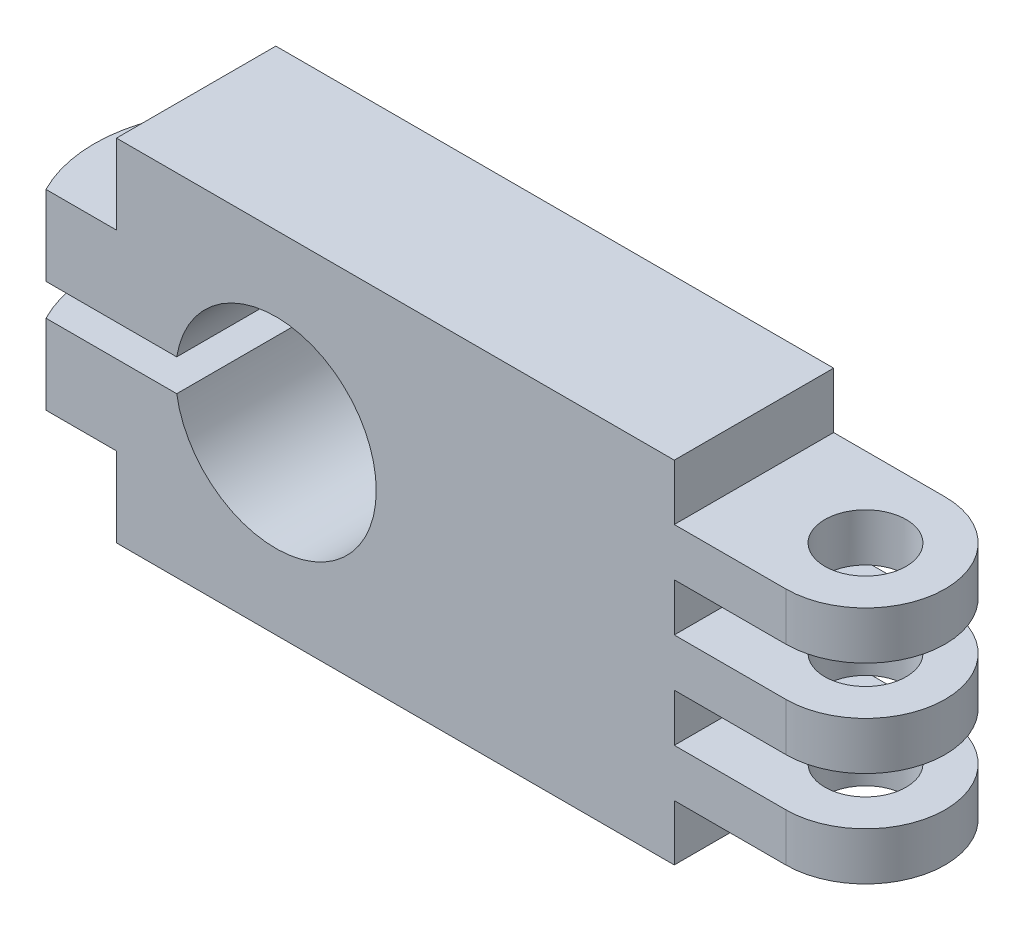
ISO-10303-21;
HEADER;
FILE_DESCRIPTION(('STEP AP214'),'2;1');
FILE_NAME('part.step','',(''),(''),'','','');
FILE_SCHEMA(('AUTOMOTIVE_DESIGN { 1 0 10303 214 1 1 1 1 }'));
ENDSEC;
DATA;
#1=APPLICATION_CONTEXT('core data for automotive mechanical design processes');
#2=APPLICATION_PROTOCOL_DEFINITION('international standard','automotive_design',2000,#1);
#3=PRODUCT_CONTEXT('',#1,'mechanical');
#4=PRODUCT('Part','Part','',(#3));
#5=PRODUCT_RELATED_PRODUCT_CATEGORY('part','',(#4));
#6=PRODUCT_DEFINITION_FORMATION('','',#4);
#7=PRODUCT_DEFINITION_CONTEXT('part definition',#1,'design');
#8=PRODUCT_DEFINITION('design','',#6,#7);
#9=PRODUCT_DEFINITION_SHAPE('','',#8);
#10=(LENGTH_UNIT() NAMED_UNIT(*) SI_UNIT(.MILLI.,.METRE.));
#11=(NAMED_UNIT(*) PLANE_ANGLE_UNIT() SI_UNIT($,.RADIAN.));
#12=(NAMED_UNIT(*) SI_UNIT($,.STERADIAN.) SOLID_ANGLE_UNIT());
#13=UNCERTAINTY_MEASURE_WITH_UNIT(LENGTH_MEASURE(1.E-05),#10,'distance_accuracy_value','');
#14=(GEOMETRIC_REPRESENTATION_CONTEXT(3) GLOBAL_UNCERTAINTY_ASSIGNED_CONTEXT((#13)) GLOBAL_UNIT_ASSIGNED_CONTEXT((#10,
#11,#12)) REPRESENTATION_CONTEXT('',''));
#15=CARTESIAN_POINT('',(0.,0.,0.));
#16=DIRECTION('',(0.,0.,1.));
#17=DIRECTION('',(1.,0.,0.));
#18=AXIS2_PLACEMENT_3D('',#15,#16,#17);
#19=CARTESIAN_POINT('',(-10.,-5.,10.));
#20=DIRECTION('',(0.,1.,0.));
#21=DIRECTION('',(0.,0.,1.));
#22=AXIS2_PLACEMENT_3D('',#19,#20,#21);
#23=PLANE('',#22);
#24=CARTESIAN_POINT('',(-2.5,-5.,6.));
#25=DIRECTION('',(0.,1.,0.));
#26=DIRECTION('',(0.,0.,1.));
#27=AXIS2_PLACEMENT_3D('',#24,#25,#26);
#28=CIRCLE('',#27,1.);
#29=CARTESIAN_POINT('',(-2.5,-5.,7.));
#30=VERTEX_POINT('',#29);
#31=EDGE_CURVE('E431',#30,#30,#28,.T.);
#32=ORIENTED_EDGE('',*,*,#31,.F.);
#33=EDGE_LOOP('',(#32));
#34=FACE_BOUND('',#33,.T.);
#35=CARTESIAN_POINT('',(3.31673634690876,-5.,6.));
#36=DIRECTION('',(0.,-1.,0.));
#37=DIRECTION('',(0.,0.,1.));
#38=AXIS2_PLACEMENT_3D('',#35,#36,#37);
#39=CIRCLE('',#38,8.71212706957137);
#40=CARTESIAN_POINT('',(-4.42284749696542,-5.,10.));
#41=VERTEX_POINT('',#40);
#42=CARTESIAN_POINT('',(-3.,-5.,0.));
#43=VERTEX_POINT('',#42);
#44=EDGE_CURVE('E49',#41,#43,#39,.T.);
#45=ORIENTED_EDGE('',*,*,#44,.F.);
#46=DIRECTION('',(1.,0.,0.));
#47=VECTOR('',#46,1.);
#48=CARTESIAN_POINT('',(-10.,-5.,10.));
#49=LINE('',#48,#47);
#50=CARTESIAN_POINT('',(0.,-5.,10.));
#51=VERTEX_POINT('',#50);
#52=EDGE_CURVE('E204',#41,#51,#49,.T.);
#53=ORIENTED_EDGE('',*,*,#52,.T.);
#54=DIRECTION('',(0.,0.,-1.));
#55=VECTOR('',#54,1.);
#56=CARTESIAN_POINT('',(0.,-5.,10.));
#57=LINE('',#56,#55);
#58=CARTESIAN_POINT('',(0.,-5.,0.));
#59=VERTEX_POINT('',#58);
#60=EDGE_CURVE('E268',#51,#59,#57,.T.);
#61=ORIENTED_EDGE('',*,*,#60,.T.);
#62=DIRECTION('',(1.,0.,0.));
#63=VECTOR('',#62,1.);
#64=CARTESIAN_POINT('',(-10.,-5.,0.));
#65=LINE('',#64,#63);
#66=EDGE_CURVE('E206',#43,#59,#65,.T.);
#67=ORIENTED_EDGE('',*,*,#66,.F.);
#68=EDGE_LOOP('',(#45,#53,#61,#67));
#69=FACE_BOUND('',#68,.T.);
#70=ADVANCED_FACE('F34',(#34,#69),#23,.T.);
#71=CARTESIAN_POINT('',(-10.,-10.,10.));
#72=DIRECTION('',(0.,1.,0.));
#73=DIRECTION('',(0.,0.,1.));
#74=AXIS2_PLACEMENT_3D('',#71,#72,#73);
#75=PLANE('',#74);
#76=CARTESIAN_POINT('',(-2.5,-10.,6.));
#77=DIRECTION('',(0.,1.,0.));
#78=DIRECTION('',(0.,0.,1.));
#79=AXIS2_PLACEMENT_3D('',#76,#77,#78);
#80=CIRCLE('',#79,1.);
#81=CARTESIAN_POINT('',(-2.5,-10.,7.));
#82=VERTEX_POINT('',#81);
#83=EDGE_CURVE('E207',#82,#82,#80,.T.);
#84=ORIENTED_EDGE('',*,*,#83,.T.);
#85=EDGE_LOOP('',(#84));
#86=FACE_BOUND('',#85,.T.);
#87=DIRECTION('',(1.,0.,0.));
#88=VECTOR('',#87,1.);
#89=CARTESIAN_POINT('',(-10.,-10.,10.));
#90=LINE('',#89,#88);
#91=CARTESIAN_POINT('',(-4.42284749696542,-10.,10.));
#92=VERTEX_POINT('',#91);
#93=CARTESIAN_POINT('',(3.7798713839664,-10.,10.));
#94=VERTEX_POINT('',#93);
#95=EDGE_CURVE('E266',#92,#94,#90,.T.);
#96=ORIENTED_EDGE('',*,*,#95,.F.);
#97=CARTESIAN_POINT('',(3.31673634690876,-10.,6.));
#98=DIRECTION('',(0.,1.,0.));
#99=DIRECTION('',(0.,0.,1.));
#100=AXIS2_PLACEMENT_3D('',#97,#98,#99);
#101=CIRCLE('',#100,8.71212706957137);
#102=CARTESIAN_POINT('',(-3.,-10.,0.));
#103=VERTEX_POINT('',#102);
#104=EDGE_CURVE('E195',#92,#103,#101,.F.);
#105=ORIENTED_EDGE('',*,*,#104,.T.);
#106=DIRECTION('',(1.,0.,0.));
#107=VECTOR('',#106,1.);
#108=CARTESIAN_POINT('',(-10.,-10.,0.));
#109=LINE('',#108,#107);
#110=CARTESIAN_POINT('',(3.7798713839664,-10.,0.));
#111=VERTEX_POINT('',#110);
#112=EDGE_CURVE('E215',#103,#111,#109,.T.);
#113=ORIENTED_EDGE('',*,*,#112,.T.);
#114=DIRECTION('',(0.,0.,1.));
#115=VECTOR('',#114,1.);
#116=CARTESIAN_POINT('',(3.7798713839664,-10.,-9.));
#117=LINE('',#116,#115);
#118=EDGE_CURVE('E365',#111,#94,#117,.T.);
#119=ORIENTED_EDGE('',*,*,#118,.T.);
#120=EDGE_LOOP('',(#96,#105,#113,#119));
#121=FACE_BOUND('',#120,.T.);
#122=ADVANCED_FACE('F351',(#86,#121),#75,.F.);
#123=CARTESIAN_POINT('',(0.,-12.,10.));
#124=DIRECTION('',(0.,-1.,0.));
#125=DIRECTION('',(0.,0.,-1.));
#126=AXIS2_PLACEMENT_3D('',#123,#124,#125);
#127=PLANE('',#126);
#128=CARTESIAN_POINT('',(-2.5,-12.,6.));
#129=DIRECTION('',(0.,-1.,0.));
#130=DIRECTION('',(0.,0.,-1.));
#131=AXIS2_PLACEMENT_3D('',#128,#129,#130);
#132=CIRCLE('',#131,1.);
#133=CARTESIAN_POINT('',(-2.5,-12.,5.));
#134=VERTEX_POINT('',#133);
#135=EDGE_CURVE('E435',#134,#134,#132,.T.);
#136=ORIENTED_EDGE('',*,*,#135,.T.);
#137=EDGE_LOOP('',(#136));
#138=FACE_BOUND('',#137,.T.);
#139=DIRECTION('',(-1.,0.,0.));
#140=VECTOR('',#139,1.);
#141=CARTESIAN_POINT('',(0.,-12.,0.));
#142=LINE('',#141,#140);
#143=CARTESIAN_POINT('',(3.7798713839664,-12.,0.));
#144=VERTEX_POINT('',#143);
#145=CARTESIAN_POINT('',(-3.,-12.,0.));
#146=VERTEX_POINT('',#145);
#147=EDGE_CURVE('E219',#144,#146,#142,.T.);
#148=ORIENTED_EDGE('',*,*,#147,.T.);
#149=CARTESIAN_POINT('',(3.31673634690876,-12.,6.));
#150=DIRECTION('',(0.,-1.,0.));
#151=DIRECTION('',(0.,0.,-1.));
#152=AXIS2_PLACEMENT_3D('',#149,#150,#151);
#153=CIRCLE('',#152,8.71212706957137);
#154=CARTESIAN_POINT('',(-4.42284749696542,-12.,10.));
#155=VERTEX_POINT('',#154);
#156=EDGE_CURVE('E57',#146,#155,#153,.F.);
#157=ORIENTED_EDGE('',*,*,#156,.T.);
#158=DIRECTION('',(-1.,0.,0.));
#159=VECTOR('',#158,1.);
#160=CARTESIAN_POINT('',(0.,-12.,10.));
#161=LINE('',#160,#159);
#162=CARTESIAN_POINT('',(3.77987138396641,-12.,10.));
#163=VERTEX_POINT('',#162);
#164=EDGE_CURVE('E263',#163,#155,#161,.T.);
#165=ORIENTED_EDGE('',*,*,#164,.F.);
#166=DIRECTION('',(0.,0.,1.));
#167=VECTOR('',#166,1.);
#168=CARTESIAN_POINT('',(3.7798713839664,-12.,-9.));
#169=LINE('',#168,#167);
#170=EDGE_CURVE('E357',#163,#144,#169,.F.);
#171=ORIENTED_EDGE('',*,*,#170,.T.);
#172=EDGE_LOOP('',(#148,#157,#165,#171));
#173=FACE_BOUND('',#172,.T.);
#174=ADVANCED_FACE('F426',(#138,#173),#127,.F.);
#175=CARTESIAN_POINT('',(0.,-17.,10.));
#176=DIRECTION('',(0.,-1.,0.));
#177=DIRECTION('',(0.,0.,-1.));
#178=AXIS2_PLACEMENT_3D('',#175,#176,#177);
#179=PLANE('',#178);
#180=CARTESIAN_POINT('',(-2.5,-17.,6.));
#181=DIRECTION('',(0.,-1.,0.));
#182=DIRECTION('',(0.,0.,-1.));
#183=AXIS2_PLACEMENT_3D('',#180,#181,#182);
#184=CIRCLE('',#183,1.);
#185=CARTESIAN_POINT('',(-2.5,-17.,5.));
#186=VERTEX_POINT('',#185);
#187=EDGE_CURVE('E37',#186,#186,#184,.T.);
#188=ORIENTED_EDGE('',*,*,#187,.F.);
#189=EDGE_LOOP('',(#188));
#190=FACE_BOUND('',#189,.T.);
#191=CARTESIAN_POINT('',(3.31673634690876,-17.,6.));
#192=DIRECTION('',(0.,-1.,0.));
#193=DIRECTION('',(0.,0.,-1.));
#194=AXIS2_PLACEMENT_3D('',#191,#192,#193);
#195=CIRCLE('',#194,8.71212706957137);
#196=CARTESIAN_POINT('',(-3.,-17.,0.));
#197=VERTEX_POINT('',#196);
#198=CARTESIAN_POINT('',(-4.42284749696542,-17.,10.));
#199=VERTEX_POINT('',#198);
#200=EDGE_CURVE('E359',#197,#199,#195,.F.);
#201=ORIENTED_EDGE('',*,*,#200,.F.);
#202=DIRECTION('',(-1.,0.,0.));
#203=VECTOR('',#202,1.);
#204=CARTESIAN_POINT('',(0.,-17.,0.));
#205=LINE('',#204,#203);
#206=CARTESIAN_POINT('',(0.,-17.,0.));
#207=VERTEX_POINT('',#206);
#208=EDGE_CURVE('E309',#207,#197,#205,.T.);
#209=ORIENTED_EDGE('',*,*,#208,.F.);
#210=DIRECTION('',(0.,0.,-1.));
#211=VECTOR('',#210,1.);
#212=CARTESIAN_POINT('',(0.,-17.,10.));
#213=LINE('',#212,#211);
#214=CARTESIAN_POINT('',(0.,-17.,10.));
#215=VERTEX_POINT('',#214);
#216=EDGE_CURVE('E314',#215,#207,#213,.T.);
#217=ORIENTED_EDGE('',*,*,#216,.F.);
#218=DIRECTION('',(-1.,0.,0.));
#219=VECTOR('',#218,1.);
#220=CARTESIAN_POINT('',(0.,-17.,10.));
#221=LINE('',#220,#219);
#222=EDGE_CURVE('E260',#215,#199,#221,.T.);
#223=ORIENTED_EDGE('',*,*,#222,.T.);
#224=EDGE_LOOP('',(#201,#209,#217,#223));
#225=FACE_BOUND('',#224,.T.);
#226=ADVANCED_FACE('F451',(#190,#225),#179,.T.);
#227=CARTESIAN_POINT('',(0.,-22.,10.));
#228=DIRECTION('',(-1.,0.,0.));
#229=DIRECTION('',(0.,0.,1.));
#230=AXIS2_PLACEMENT_3D('',#227,#228,#229);
#231=PLANE('',#230);
#232=DIRECTION('',(0.,1.,0.));
#233=VECTOR('',#232,1.);
#234=CARTESIAN_POINT('',(0.,-22.,0.));
#235=LINE('',#234,#233);
#236=CARTESIAN_POINT('',(0.,-22.,0.));
#237=VERTEX_POINT('',#236);
#238=EDGE_CURVE('E306',#237,#207,#235,.T.);
#239=ORIENTED_EDGE('',*,*,#238,.F.);
#240=DIRECTION('',(0.,0.,-1.));
#241=VECTOR('',#240,1.);
#242=CARTESIAN_POINT('',(0.,-22.,10.));
#243=LINE('',#242,#241);
#244=CARTESIAN_POINT('',(0.,-22.,10.));
#245=VERTEX_POINT('',#244);
#246=EDGE_CURVE('E317',#245,#237,#243,.T.);
#247=ORIENTED_EDGE('',*,*,#246,.F.);
#248=DIRECTION('',(0.,1.,0.));
#249=VECTOR('',#248,1.);
#250=CARTESIAN_POINT('',(0.,-22.,10.));
#251=LINE('',#250,#249);
#252=EDGE_CURVE('E257',#245,#215,#251,.T.);
#253=ORIENTED_EDGE('',*,*,#252,.T.);
#254=ORIENTED_EDGE('',*,*,#216,.T.);
#255=EDGE_LOOP('',(#239,#247,#253,#254));
#256=FACE_BOUND('',#255,.T.);
#257=ADVANCED_FACE('F456',(#256),#231,.T.);
#258=CARTESIAN_POINT('',(35.,-22.,10.));
#259=DIRECTION('',(0.,-1.,0.));
#260=DIRECTION('',(0.,0.,-1.));
#261=AXIS2_PLACEMENT_3D('',#258,#259,#260);
#262=PLANE('',#261);
#263=DIRECTION('',(-1.,0.,0.));
#264=VECTOR('',#263,1.);
#265=CARTESIAN_POINT('',(35.,-22.,0.));
#266=LINE('',#265,#264);
#267=CARTESIAN_POINT('',(35.,-22.,0.));
#268=VERTEX_POINT('',#267);
#269=EDGE_CURVE('E303',#268,#237,#266,.T.);
#270=ORIENTED_EDGE('',*,*,#269,.F.);
#271=DIRECTION('',(0.,0.,-1.));
#272=VECTOR('',#271,1.);
#273=CARTESIAN_POINT('',(35.,-22.,10.));
#274=LINE('',#273,#272);
#275=CARTESIAN_POINT('',(35.,-22.,10.));
#276=VERTEX_POINT('',#275);
#277=EDGE_CURVE('E319',#276,#268,#274,.T.);
#278=ORIENTED_EDGE('',*,*,#277,.F.);
#279=DIRECTION('',(-1.,0.,0.));
#280=VECTOR('',#279,1.);
#281=CARTESIAN_POINT('',(35.,-22.,10.));
#282=LINE('',#281,#280);
#283=EDGE_CURVE('E254',#276,#245,#282,.T.);
#284=ORIENTED_EDGE('',*,*,#283,.T.);
#285=ORIENTED_EDGE('',*,*,#246,.T.);
#286=EDGE_LOOP('',(#270,#278,#284,#285));
#287=FACE_BOUND('',#286,.T.);
#288=ADVANCED_FACE('F417',(#287),#262,.T.);
#289=CARTESIAN_POINT('',(35.,-18.5,10.));
#290=DIRECTION('',(1.,0.,0.));
#291=DIRECTION('',(0.,0.,-1.));
#292=AXIS2_PLACEMENT_3D('',#289,#290,#291);
#293=PLANE('',#292);
#294=DIRECTION('',(0.,-1.,0.));
#295=VECTOR('',#294,1.);
#296=CARTESIAN_POINT('',(35.,-18.5,0.));
#297=LINE('',#296,#295);
#298=CARTESIAN_POINT('',(35.,-18.5,0.));
#299=VERTEX_POINT('',#298);
#300=EDGE_CURVE('E300',#299,#268,#297,.T.);
#301=ORIENTED_EDGE('',*,*,#300,.F.);
#302=DIRECTION('',(0.,0.,-1.));
#303=VECTOR('',#302,1.);
#304=CARTESIAN_POINT('',(35.,-18.5,10.));
#305=LINE('',#304,#303);
#306=CARTESIAN_POINT('',(35.,-18.5,10.));
#307=VERTEX_POINT('',#306);
#308=EDGE_CURVE('E321',#307,#299,#305,.T.);
#309=ORIENTED_EDGE('',*,*,#308,.F.);
#310=DIRECTION('',(0.,-1.,0.));
#311=VECTOR('',#310,1.);
#312=CARTESIAN_POINT('',(35.,-18.5,10.));
#313=LINE('',#312,#311);
#314=EDGE_CURVE('E251',#307,#276,#313,.T.);
#315=ORIENTED_EDGE('',*,*,#314,.T.);
#316=ORIENTED_EDGE('',*,*,#277,.T.);
#317=EDGE_LOOP('',(#301,#309,#315,#316));
#318=FACE_BOUND('',#317,.T.);
#319=ADVANCED_FACE('F407',(#318),#293,.T.);
#320=CARTESIAN_POINT('',(47.,-18.5,10.));
#321=DIRECTION('',(0.,-1.,0.));
#322=DIRECTION('',(0.,0.,-1.));
#323=AXIS2_PLACEMENT_3D('',#320,#321,#322);
#324=PLANE('',#323);
#325=CARTESIAN_POINT('',(42.,-18.5,5.));
#326=DIRECTION('',(0.,-1.,0.));
#327=DIRECTION('',(0.,0.,-1.));
#328=AXIS2_PLACEMENT_3D('',#325,#326,#327);
#329=CIRCLE('',#328,5.);
#330=CARTESIAN_POINT('',(42.,-18.5,10.));
#331=VERTEX_POINT('',#330);
#332=CARTESIAN_POINT('',(42.,-18.5,0.));
#333=VERTEX_POINT('',#332);
#334=EDGE_CURVE('E382',#331,#333,#329,.F.);
#335=ORIENTED_EDGE('',*,*,#334,.F.);
#336=DIRECTION('',(-1.,0.,0.));
#337=VECTOR('',#336,1.);
#338=CARTESIAN_POINT('',(47.,-18.5,10.));
#339=LINE('',#338,#337);
#340=EDGE_CURVE('E249',#331,#307,#339,.T.);
#341=ORIENTED_EDGE('',*,*,#340,.T.);
#342=ORIENTED_EDGE('',*,*,#308,.T.);
#343=DIRECTION('',(-1.,0.,0.));
#344=VECTOR('',#343,1.);
#345=CARTESIAN_POINT('',(47.,-18.5,0.));
#346=LINE('',#345,#344);
#347=EDGE_CURVE('E298',#333,#299,#346,.T.);
#348=ORIENTED_EDGE('',*,*,#347,.F.);
#349=EDGE_LOOP('',(#335,#341,#342,#348));
#350=FACE_BOUND('',#349,.T.);
#351=CARTESIAN_POINT('',(42.,-18.5,5.));
#352=DIRECTION('',(0.,-1.,0.));
#353=DIRECTION('',(0.,0.,-1.));
#354=AXIS2_PLACEMENT_3D('',#351,#352,#353);
#355=CIRCLE('',#354,2.55);
#356=CARTESIAN_POINT('',(42.,-18.5,2.45));
#357=VERTEX_POINT('',#356);
#358=EDGE_CURVE('E222',#357,#357,#355,.T.);
#359=ORIENTED_EDGE('',*,*,#358,.F.);
#360=EDGE_LOOP('',(#359));
#361=FACE_BOUND('',#360,.T.);
#362=ADVANCED_FACE('F404',(#350,#361),#324,.T.);
#363=CARTESIAN_POINT('',(35.,-15.5,10.));
#364=DIRECTION('',(0.,1.,0.));
#365=DIRECTION('',(0.,0.,1.));
#366=AXIS2_PLACEMENT_3D('',#363,#364,#365);
#367=PLANE('',#366);
#368=CARTESIAN_POINT('',(42.,-15.5,5.));
#369=DIRECTION('',(0.,1.,0.));
#370=DIRECTION('',(0.,0.,1.));
#371=AXIS2_PLACEMENT_3D('',#368,#369,#370);
#372=CIRCLE('',#371,5.);
#373=CARTESIAN_POINT('',(42.,-15.5,0.));
#374=VERTEX_POINT('',#373);
#375=CARTESIAN_POINT('',(42.,-15.5,10.));
#376=VERTEX_POINT('',#375);
#377=EDGE_CURVE('E380',#374,#376,#372,.F.);
#378=ORIENTED_EDGE('',*,*,#377,.F.);
#379=DIRECTION('',(1.,0.,0.));
#380=VECTOR('',#379,1.);
#381=CARTESIAN_POINT('',(35.,-15.5,0.));
#382=LINE('',#381,#380);
#383=CARTESIAN_POINT('',(35.,-15.5,0.));
#384=VERTEX_POINT('',#383);
#385=EDGE_CURVE('E295',#384,#374,#382,.T.);
#386=ORIENTED_EDGE('',*,*,#385,.F.);
#387=DIRECTION('',(0.,0.,-1.));
#388=VECTOR('',#387,1.);
#389=CARTESIAN_POINT('',(35.,-15.5,10.));
#390=LINE('',#389,#388);
#391=CARTESIAN_POINT('',(35.,-15.5,10.));
#392=VERTEX_POINT('',#391);
#393=EDGE_CURVE('E324',#392,#384,#390,.T.);
#394=ORIENTED_EDGE('',*,*,#393,.F.);
#395=DIRECTION('',(1.,0.,0.));
#396=VECTOR('',#395,1.);
#397=CARTESIAN_POINT('',(35.,-15.5,10.));
#398=LINE('',#397,#396);
#399=EDGE_CURVE('E246',#392,#376,#398,.T.);
#400=ORIENTED_EDGE('',*,*,#399,.T.);
#401=EDGE_LOOP('',(#378,#386,#394,#400));
#402=FACE_BOUND('',#401,.T.);
#403=CARTESIAN_POINT('',(42.,-15.5,5.));
#404=DIRECTION('',(0.,1.,0.));
#405=DIRECTION('',(0.,0.,1.));
#406=AXIS2_PLACEMENT_3D('',#403,#404,#405);
#407=CIRCLE('',#406,2.55);
#408=CARTESIAN_POINT('',(42.,-15.5,7.55));
#409=VERTEX_POINT('',#408);
#410=EDGE_CURVE('E395',#409,#409,#407,.T.);
#411=ORIENTED_EDGE('',*,*,#410,.F.);
#412=EDGE_LOOP('',(#411));
#413=FACE_BOUND('',#412,.T.);
#414=ADVANCED_FACE('F406',(#402,#413),#367,.T.);
#415=CARTESIAN_POINT('',(35.,-12.5,10.));
#416=DIRECTION('',(1.,0.,0.));
#417=DIRECTION('',(0.,0.,-1.));
#418=AXIS2_PLACEMENT_3D('',#415,#416,#417);
#419=PLANE('',#418);
#420=DIRECTION('',(0.,-1.,0.));
#421=VECTOR('',#420,1.);
#422=CARTESIAN_POINT('',(35.,-12.5,0.));
#423=LINE('',#422,#421);
#424=CARTESIAN_POINT('',(35.,-12.5,0.));
#425=VERTEX_POINT('',#424);
#426=EDGE_CURVE('E292',#425,#384,#423,.T.);
#427=ORIENTED_EDGE('',*,*,#426,.F.);
#428=DIRECTION('',(0.,0.,-1.));
#429=VECTOR('',#428,1.);
#430=CARTESIAN_POINT('',(35.,-12.5,10.));
#431=LINE('',#430,#429);
#432=CARTESIAN_POINT('',(35.,-12.5,10.));
#433=VERTEX_POINT('',#432);
#434=EDGE_CURVE('E326',#433,#425,#431,.T.);
#435=ORIENTED_EDGE('',*,*,#434,.F.);
#436=DIRECTION('',(0.,-1.,0.));
#437=VECTOR('',#436,1.);
#438=CARTESIAN_POINT('',(35.,-12.5,10.));
#439=LINE('',#438,#437);
#440=EDGE_CURVE('E243',#433,#392,#439,.T.);
#441=ORIENTED_EDGE('',*,*,#440,.T.);
#442=ORIENTED_EDGE('',*,*,#393,.T.);
#443=EDGE_LOOP('',(#427,#435,#441,#442));
#444=FACE_BOUND('',#443,.T.);
#445=ADVANCED_FACE('F414',(#444),#419,.T.);
#446=CARTESIAN_POINT('',(47.,-12.5,10.));
#447=DIRECTION('',(0.,-1.,0.));
#448=DIRECTION('',(0.,0.,-1.));
#449=AXIS2_PLACEMENT_3D('',#446,#447,#448);
#450=PLANE('',#449);
#451=CARTESIAN_POINT('',(42.,-12.5,5.));
#452=DIRECTION('',(0.,-1.,0.));
#453=DIRECTION('',(0.,0.,-1.));
#454=AXIS2_PLACEMENT_3D('',#451,#452,#453);
#455=CIRCLE('',#454,5.);
#456=CARTESIAN_POINT('',(42.,-12.5,10.));
#457=VERTEX_POINT('',#456);
#458=CARTESIAN_POINT('',(42.,-12.5,0.));
#459=VERTEX_POINT('',#458);
#460=EDGE_CURVE('E378',#457,#459,#455,.F.);
#461=ORIENTED_EDGE('',*,*,#460,.F.);
#462=DIRECTION('',(-1.,0.,0.));
#463=VECTOR('',#462,1.);
#464=CARTESIAN_POINT('',(47.,-12.5,10.));
#465=LINE('',#464,#463);
#466=EDGE_CURVE('E241',#457,#433,#465,.T.);
#467=ORIENTED_EDGE('',*,*,#466,.T.);
#468=ORIENTED_EDGE('',*,*,#434,.T.);
#469=DIRECTION('',(-1.,0.,0.));
#470=VECTOR('',#469,1.);
#471=CARTESIAN_POINT('',(47.,-12.5,0.));
#472=LINE('',#471,#470);
#473=EDGE_CURVE('E290',#459,#425,#472,.T.);
#474=ORIENTED_EDGE('',*,*,#473,.F.);
#475=EDGE_LOOP('',(#461,#467,#468,#474));
#476=FACE_BOUND('',#475,.T.);
#477=CARTESIAN_POINT('',(42.,-12.5,5.));
#478=DIRECTION('',(0.,-1.,0.));
#479=DIRECTION('',(0.,0.,-1.));
#480=AXIS2_PLACEMENT_3D('',#477,#478,#479);
#481=CIRCLE('',#480,2.55);
#482=CARTESIAN_POINT('',(42.,-12.5,2.45));
#483=VERTEX_POINT('',#482);
#484=EDGE_CURVE('E393',#483,#483,#481,.T.);
#485=ORIENTED_EDGE('',*,*,#484,.F.);
#486=EDGE_LOOP('',(#485));
#487=FACE_BOUND('',#486,.T.);
#488=ADVANCED_FACE('F479',(#476,#487),#450,.T.);
#489=CARTESIAN_POINT('',(35.,-9.5,10.));
#490=DIRECTION('',(0.,1.,0.));
#491=DIRECTION('',(0.,0.,1.));
#492=AXIS2_PLACEMENT_3D('',#489,#490,#491);
#493=PLANE('',#492);
#494=CARTESIAN_POINT('',(42.,-9.5,5.));
#495=DIRECTION('',(0.,1.,0.));
#496=DIRECTION('',(0.,0.,1.));
#497=AXIS2_PLACEMENT_3D('',#494,#495,#496);
#498=CIRCLE('',#497,5.);
#499=CARTESIAN_POINT('',(42.,-9.5,0.));
#500=VERTEX_POINT('',#499);
#501=CARTESIAN_POINT('',(42.,-9.5,10.));
#502=VERTEX_POINT('',#501);
#503=EDGE_CURVE('E376',#500,#502,#498,.F.);
#504=ORIENTED_EDGE('',*,*,#503,.F.);
#505=DIRECTION('',(1.,0.,0.));
#506=VECTOR('',#505,1.);
#507=CARTESIAN_POINT('',(35.,-9.5,0.));
#508=LINE('',#507,#506);
#509=CARTESIAN_POINT('',(35.,-9.5,0.));
#510=VERTEX_POINT('',#509);
#511=EDGE_CURVE('E287',#510,#500,#508,.T.);
#512=ORIENTED_EDGE('',*,*,#511,.F.);
#513=DIRECTION('',(0.,0.,-1.));
#514=VECTOR('',#513,1.);
#515=CARTESIAN_POINT('',(35.,-9.5,10.));
#516=LINE('',#515,#514);
#517=CARTESIAN_POINT('',(35.,-9.5,10.));
#518=VERTEX_POINT('',#517);
#519=EDGE_CURVE('E329',#518,#510,#516,.T.);
#520=ORIENTED_EDGE('',*,*,#519,.F.);
#521=DIRECTION('',(1.,0.,0.));
#522=VECTOR('',#521,1.);
#523=CARTESIAN_POINT('',(35.,-9.5,10.));
#524=LINE('',#523,#522);
#525=EDGE_CURVE('E238',#518,#502,#524,.T.);
#526=ORIENTED_EDGE('',*,*,#525,.T.);
#527=EDGE_LOOP('',(#504,#512,#520,#526));
#528=FACE_BOUND('',#527,.T.);
#529=CARTESIAN_POINT('',(42.,-9.5,5.));
#530=DIRECTION('',(0.,1.,0.));
#531=DIRECTION('',(0.,0.,1.));
#532=AXIS2_PLACEMENT_3D('',#529,#530,#531);
#533=CIRCLE('',#532,2.55);
#534=CARTESIAN_POINT('',(42.,-9.5,7.55));
#535=VERTEX_POINT('',#534);
#536=EDGE_CURVE('E390',#535,#535,#533,.T.);
#537=ORIENTED_EDGE('',*,*,#536,.F.);
#538=EDGE_LOOP('',(#537));
#539=FACE_BOUND('',#538,.T.);
#540=ADVANCED_FACE('F503',(#528,#539),#493,.T.);
#541=CARTESIAN_POINT('',(35.,-6.5,10.));
#542=DIRECTION('',(1.,0.,0.));
#543=DIRECTION('',(0.,0.,-1.));
#544=AXIS2_PLACEMENT_3D('',#541,#542,#543);
#545=PLANE('',#544);
#546=DIRECTION('',(0.,-1.,0.));
#547=VECTOR('',#546,1.);
#548=CARTESIAN_POINT('',(35.,-6.5,0.));
#549=LINE('',#548,#547);
#550=CARTESIAN_POINT('',(35.,-6.5,0.));
#551=VERTEX_POINT('',#550);
#552=EDGE_CURVE('E284',#551,#510,#549,.T.);
#553=ORIENTED_EDGE('',*,*,#552,.F.);
#554=DIRECTION('',(0.,0.,-1.));
#555=VECTOR('',#554,1.);
#556=CARTESIAN_POINT('',(35.,-6.5,10.));
#557=LINE('',#556,#555);
#558=CARTESIAN_POINT('',(35.,-6.5,10.));
#559=VERTEX_POINT('',#558);
#560=EDGE_CURVE('E331',#559,#551,#557,.T.);
#561=ORIENTED_EDGE('',*,*,#560,.F.);
#562=DIRECTION('',(0.,-1.,0.));
#563=VECTOR('',#562,1.);
#564=CARTESIAN_POINT('',(35.,-6.5,10.));
#565=LINE('',#564,#563);
#566=EDGE_CURVE('E235',#559,#518,#565,.T.);
#567=ORIENTED_EDGE('',*,*,#566,.T.);
#568=ORIENTED_EDGE('',*,*,#519,.T.);
#569=EDGE_LOOP('',(#553,#561,#567,#568));
#570=FACE_BOUND('',#569,.T.);
#571=ADVANCED_FACE('F501',(#570),#545,.T.);
#572=CARTESIAN_POINT('',(47.,-6.5,10.));
#573=DIRECTION('',(0.,-1.,0.));
#574=DIRECTION('',(0.,0.,-1.));
#575=AXIS2_PLACEMENT_3D('',#572,#573,#574);
#576=PLANE('',#575);
#577=CARTESIAN_POINT('',(42.,-6.5,5.));
#578=DIRECTION('',(0.,-1.,0.));
#579=DIRECTION('',(0.,0.,-1.));
#580=AXIS2_PLACEMENT_3D('',#577,#578,#579);
#581=CIRCLE('',#580,5.);
#582=CARTESIAN_POINT('',(42.,-6.5,10.));
#583=VERTEX_POINT('',#582);
#584=CARTESIAN_POINT('',(42.,-6.5,0.));
#585=VERTEX_POINT('',#584);
#586=EDGE_CURVE('E374',#583,#585,#581,.F.);
#587=ORIENTED_EDGE('',*,*,#586,.F.);
#588=DIRECTION('',(-1.,0.,0.));
#589=VECTOR('',#588,1.);
#590=CARTESIAN_POINT('',(47.,-6.5,10.));
#591=LINE('',#590,#589);
#592=EDGE_CURVE('E233',#583,#559,#591,.T.);
#593=ORIENTED_EDGE('',*,*,#592,.T.);
#594=ORIENTED_EDGE('',*,*,#560,.T.);
#595=DIRECTION('',(-1.,0.,0.));
#596=VECTOR('',#595,1.);
#597=CARTESIAN_POINT('',(47.,-6.5,0.));
#598=LINE('',#597,#596);
#599=EDGE_CURVE('E282',#585,#551,#598,.T.);
#600=ORIENTED_EDGE('',*,*,#599,.F.);
#601=EDGE_LOOP('',(#587,#593,#594,#600));
#602=FACE_BOUND('',#601,.T.);
#603=CARTESIAN_POINT('',(42.,-6.5,5.));
#604=DIRECTION('',(0.,-1.,0.));
#605=DIRECTION('',(0.,0.,-1.));
#606=AXIS2_PLACEMENT_3D('',#603,#604,#605);
#607=CIRCLE('',#606,2.55);
#608=CARTESIAN_POINT('',(42.,-6.5,2.45));
#609=VERTEX_POINT('',#608);
#610=EDGE_CURVE('E387',#609,#609,#607,.T.);
#611=ORIENTED_EDGE('',*,*,#610,.F.);
#612=EDGE_LOOP('',(#611));
#613=FACE_BOUND('',#612,.T.);
#614=ADVANCED_FACE('F494',(#602,#613),#576,.T.);
#615=CARTESIAN_POINT('',(35.,-3.5,10.));
#616=DIRECTION('',(0.,1.,0.));
#617=DIRECTION('',(0.,0.,1.));
#618=AXIS2_PLACEMENT_3D('',#615,#616,#617);
#619=PLANE('',#618);
#620=CARTESIAN_POINT('',(42.,-3.5,5.));
#621=DIRECTION('',(0.,-1.,0.));
#622=DIRECTION('',(0.,0.,1.));
#623=AXIS2_PLACEMENT_3D('',#620,#621,#622);
#624=CIRCLE('',#623,5.);
#625=CARTESIAN_POINT('',(42.,-3.5,0.));
#626=VERTEX_POINT('',#625);
#627=CARTESIAN_POINT('',(42.,-3.5,10.));
#628=VERTEX_POINT('',#627);
#629=EDGE_CURVE('E367',#626,#628,#624,.T.);
#630=ORIENTED_EDGE('',*,*,#629,.F.);
#631=DIRECTION('',(1.,0.,0.));
#632=VECTOR('',#631,1.);
#633=CARTESIAN_POINT('',(35.,-3.5,0.));
#634=LINE('',#633,#632);
#635=CARTESIAN_POINT('',(35.,-3.5,0.));
#636=VERTEX_POINT('',#635);
#637=EDGE_CURVE('E279',#636,#626,#634,.T.);
#638=ORIENTED_EDGE('',*,*,#637,.F.);
#639=DIRECTION('',(0.,0.,-1.));
#640=VECTOR('',#639,1.);
#641=CARTESIAN_POINT('',(35.,-3.5,10.));
#642=LINE('',#641,#640);
#643=CARTESIAN_POINT('',(35.,-3.5,10.));
#644=VERTEX_POINT('',#643);
#645=EDGE_CURVE('E334',#644,#636,#642,.T.);
#646=ORIENTED_EDGE('',*,*,#645,.F.);
#647=DIRECTION('',(1.,0.,0.));
#648=VECTOR('',#647,1.);
#649=CARTESIAN_POINT('',(35.,-3.5,10.));
#650=LINE('',#649,#648);
#651=EDGE_CURVE('E230',#644,#628,#650,.T.);
#652=ORIENTED_EDGE('',*,*,#651,.T.);
#653=EDGE_LOOP('',(#630,#638,#646,#652));
#654=FACE_BOUND('',#653,.T.);
#655=CARTESIAN_POINT('',(42.,-3.5,5.));
#656=DIRECTION('',(0.,1.,0.));
#657=DIRECTION('',(0.,0.,1.));
#658=AXIS2_PLACEMENT_3D('',#655,#656,#657);
#659=CIRCLE('',#658,2.55);
#660=CARTESIAN_POINT('',(42.,-3.5,7.55));
#661=VERTEX_POINT('',#660);
#662=EDGE_CURVE('E384',#661,#661,#659,.T.);
#663=ORIENTED_EDGE('',*,*,#662,.F.);
#664=EDGE_LOOP('',(#663));
#665=FACE_BOUND('',#664,.T.);
#666=ADVANCED_FACE('F508',(#654,#665),#619,.T.);
#667=CARTESIAN_POINT('',(35.,0.,10.));
#668=DIRECTION('',(1.,0.,0.));
#669=DIRECTION('',(0.,0.,-1.));
#670=AXIS2_PLACEMENT_3D('',#667,#668,#669);
#671=PLANE('',#670);
#672=DIRECTION('',(0.,-1.,0.));
#673=VECTOR('',#672,1.);
#674=CARTESIAN_POINT('',(35.,0.,0.));
#675=LINE('',#674,#673);
#676=CARTESIAN_POINT('',(35.,0.,0.));
#677=VERTEX_POINT('',#676);
#678=EDGE_CURVE('E276',#677,#636,#675,.T.);
#679=ORIENTED_EDGE('',*,*,#678,.F.);
#680=DIRECTION('',(0.,0.,-1.));
#681=VECTOR('',#680,1.);
#682=CARTESIAN_POINT('',(35.,0.,10.));
#683=LINE('',#682,#681);
#684=CARTESIAN_POINT('',(35.,0.,10.));
#685=VERTEX_POINT('',#684);
#686=EDGE_CURVE('E336',#685,#677,#683,.T.);
#687=ORIENTED_EDGE('',*,*,#686,.F.);
#688=DIRECTION('',(0.,-1.,0.));
#689=VECTOR('',#688,1.);
#690=CARTESIAN_POINT('',(35.,0.,10.));
#691=LINE('',#690,#689);
#692=EDGE_CURVE('E227',#685,#644,#691,.T.);
#693=ORIENTED_EDGE('',*,*,#692,.T.);
#694=ORIENTED_EDGE('',*,*,#645,.T.);
#695=EDGE_LOOP('',(#679,#687,#693,#694));
#696=FACE_BOUND('',#695,.T.);
#697=ADVANCED_FACE('F512',(#696),#671,.T.);
#698=CARTESIAN_POINT('',(0.,0.,10.));
#699=DIRECTION('',(0.,1.,0.));
#700=DIRECTION('',(0.,0.,1.));
#701=AXIS2_PLACEMENT_3D('',#698,#699,#700);
#702=PLANE('',#701);
#703=DIRECTION('',(1.,0.,0.));
#704=VECTOR('',#703,1.);
#705=CARTESIAN_POINT('',(0.,0.,0.));
#706=LINE('',#705,#704);
#707=CARTESIAN_POINT('',(0.,0.,0.));
#708=VERTEX_POINT('',#707);
#709=EDGE_CURVE('E273',#708,#677,#706,.T.);
#710=ORIENTED_EDGE('',*,*,#709,.F.);
#711=DIRECTION('',(0.,0.,-1.));
#712=VECTOR('',#711,1.);
#713=CARTESIAN_POINT('',(0.,0.,10.));
#714=LINE('',#713,#712);
#715=CARTESIAN_POINT('',(0.,0.,10.));
#716=VERTEX_POINT('',#715);
#717=EDGE_CURVE('E338',#716,#708,#714,.T.);
#718=ORIENTED_EDGE('',*,*,#717,.F.);
#719=DIRECTION('',(1.,0.,0.));
#720=VECTOR('',#719,1.);
#721=CARTESIAN_POINT('',(0.,0.,10.));
#722=LINE('',#721,#720);
#723=EDGE_CURVE('E217',#716,#685,#722,.T.);
#724=ORIENTED_EDGE('',*,*,#723,.T.);
#725=ORIENTED_EDGE('',*,*,#686,.T.);
#726=EDGE_LOOP('',(#710,#718,#724,#725));
#727=FACE_BOUND('',#726,.T.);
#728=ADVANCED_FACE('F515',(#727),#702,.T.);
#729=CARTESIAN_POINT('',(0.,-5.,10.));
#730=DIRECTION('',(-1.,0.,0.));
#731=DIRECTION('',(0.,-1.,0.));
#732=AXIS2_PLACEMENT_3D('',#729,#730,#731);
#733=PLANE('',#732);
#734=DIRECTION('',(0.,1.,0.));
#735=VECTOR('',#734,1.);
#736=CARTESIAN_POINT('',(0.,-5.,0.));
#737=LINE('',#736,#735);
#738=EDGE_CURVE('E270',#59,#708,#737,.T.);
#739=ORIENTED_EDGE('',*,*,#738,.F.);
#740=ORIENTED_EDGE('',*,*,#60,.F.);
#741=DIRECTION('',(0.,1.,0.));
#742=VECTOR('',#741,1.);
#743=CARTESIAN_POINT('',(0.,-5.,10.));
#744=LINE('',#743,#742);
#745=EDGE_CURVE('E214',#51,#716,#744,.T.);
#746=ORIENTED_EDGE('',*,*,#745,.T.);
#747=ORIENTED_EDGE('',*,*,#717,.T.);
#748=EDGE_LOOP('',(#739,#740,#746,#747));
#749=FACE_BOUND('',#748,.T.);
#750=ADVANCED_FACE('F518',(#749),#733,.T.);
#751=CARTESIAN_POINT('',(0.,0.,10.));
#752=DIRECTION('',(0.,0.,1.));
#753=DIRECTION('',(1.,0.,0.));
#754=AXIS2_PLACEMENT_3D('',#751,#752,#753);
#755=PLANE('',#754);
#756=DIRECTION('',(0.,1.,0.));
#757=VECTOR('',#756,1.);
#758=CARTESIAN_POINT('',(-4.42284749696542,-24.,10.));
#759=LINE('',#758,#757);
#760=EDGE_CURVE('E199',#199,#155,#759,.T.);
#761=ORIENTED_EDGE('',*,*,#760,.F.);
#762=ORIENTED_EDGE('',*,*,#222,.F.);
#763=ORIENTED_EDGE('',*,*,#252,.F.);
#764=ORIENTED_EDGE('',*,*,#283,.F.);
#765=ORIENTED_EDGE('',*,*,#314,.F.);
#766=ORIENTED_EDGE('',*,*,#340,.F.);
#767=DIRECTION('',(0.,1.,0.));
#768=VECTOR('',#767,1.);
#769=CARTESIAN_POINT('',(42.,-22.5,10.));
#770=LINE('',#769,#768);
#771=EDGE_CURVE('E373',#331,#376,#770,.T.);
#772=ORIENTED_EDGE('',*,*,#771,.T.);
#773=ORIENTED_EDGE('',*,*,#399,.F.);
#774=ORIENTED_EDGE('',*,*,#440,.F.);
#775=ORIENTED_EDGE('',*,*,#466,.F.);
#776=EDGE_CURVE('E372',#457,#502,#770,.T.);
#777=ORIENTED_EDGE('',*,*,#776,.T.);
#778=ORIENTED_EDGE('',*,*,#525,.F.);
#779=ORIENTED_EDGE('',*,*,#566,.F.);
#780=ORIENTED_EDGE('',*,*,#592,.F.);
#781=EDGE_CURVE('E369',#583,#628,#770,.T.);
#782=ORIENTED_EDGE('',*,*,#781,.T.);
#783=ORIENTED_EDGE('',*,*,#651,.F.);
#784=ORIENTED_EDGE('',*,*,#692,.F.);
#785=ORIENTED_EDGE('',*,*,#723,.F.);
#786=ORIENTED_EDGE('',*,*,#745,.F.);
#787=ORIENTED_EDGE('',*,*,#52,.F.);
#788=EDGE_CURVE('E192',#92,#41,#759,.T.);
#789=ORIENTED_EDGE('',*,*,#788,.F.);
#790=ORIENTED_EDGE('',*,*,#95,.T.);
#791=CARTESIAN_POINT('',(10.,-11.,10.));
#792=DIRECTION('',(0.,0.,1.));
#793=DIRECTION('',(1.,0.,0.));
#794=AXIS2_PLACEMENT_3D('',#791,#792,#793);
#795=CIRCLE('',#794,6.3);
#796=EDGE_CURVE('E354',#163,#94,#795,.T.);
#797=ORIENTED_EDGE('',*,*,#796,.F.);
#798=ORIENTED_EDGE('',*,*,#164,.T.);
#799=EDGE_LOOP('',(#761,#762,#763,#764,#765,#766,#772,#773,#774,#775,#777,#778,#779,#780,#782,
#783,#784,#785,#786,#787,#789,#790,#797,#798));
#800=FACE_BOUND('',#799,.T.);
#801=ADVANCED_FACE('F211',(#800),#755,.T.);
#802=CARTESIAN_POINT('',(0.,0.,0.));
#803=DIRECTION('',(0.,0.,1.));
#804=DIRECTION('',(1.,0.,0.));
#805=AXIS2_PLACEMENT_3D('',#802,#803,#804);
#806=PLANE('',#805);
#807=ORIENTED_EDGE('',*,*,#208,.T.);
#808=DIRECTION('',(0.,1.,0.));
#809=VECTOR('',#808,1.);
#810=CARTESIAN_POINT('',(-3.,0.,0.));
#811=LINE('',#810,#809);
#812=EDGE_CURVE('E11',#197,#146,#811,.T.);
#813=ORIENTED_EDGE('',*,*,#812,.T.);
#814=ORIENTED_EDGE('',*,*,#147,.F.);
#815=CARTESIAN_POINT('',(10.,-11.,0.));
#816=DIRECTION('',(0.,0.,1.));
#817=DIRECTION('',(1.,0.,0.));
#818=AXIS2_PLACEMENT_3D('',#815,#816,#817);
#819=CIRCLE('',#818,6.3);
#820=EDGE_CURVE('E345',#144,#111,#819,.T.);
#821=ORIENTED_EDGE('',*,*,#820,.T.);
#822=ORIENTED_EDGE('',*,*,#112,.F.);
#823=EDGE_CURVE('E42',#103,#43,#811,.T.);
#824=ORIENTED_EDGE('',*,*,#823,.T.);
#825=ORIENTED_EDGE('',*,*,#66,.T.);
#826=ORIENTED_EDGE('',*,*,#738,.T.);
#827=ORIENTED_EDGE('',*,*,#709,.T.);
#828=ORIENTED_EDGE('',*,*,#678,.T.);
#829=ORIENTED_EDGE('',*,*,#637,.T.);
#830=DIRECTION('',(0.,1.,0.));
#831=VECTOR('',#830,1.);
#832=CARTESIAN_POINT('',(42.,-22.5,0.));
#833=LINE('',#832,#831);
#834=EDGE_CURVE('E344',#626,#585,#833,.F.);
#835=ORIENTED_EDGE('',*,*,#834,.T.);
#836=ORIENTED_EDGE('',*,*,#599,.T.);
#837=ORIENTED_EDGE('',*,*,#552,.T.);
#838=ORIENTED_EDGE('',*,*,#511,.T.);
#839=EDGE_CURVE('E343',#500,#459,#833,.F.);
#840=ORIENTED_EDGE('',*,*,#839,.T.);
#841=ORIENTED_EDGE('',*,*,#473,.T.);
#842=ORIENTED_EDGE('',*,*,#426,.T.);
#843=ORIENTED_EDGE('',*,*,#385,.T.);
#844=EDGE_CURVE('E316',#374,#333,#833,.F.);
#845=ORIENTED_EDGE('',*,*,#844,.T.);
#846=ORIENTED_EDGE('',*,*,#347,.T.);
#847=ORIENTED_EDGE('',*,*,#300,.T.);
#848=ORIENTED_EDGE('',*,*,#269,.T.);
#849=ORIENTED_EDGE('',*,*,#238,.T.);
#850=EDGE_LOOP('',(#807,#813,#814,#821,#822,#824,#825,#826,#827,#828,#829,#835,#836,#837,#838,
#840,#841,#842,#843,#845,#846,#847,#848,#849));
#851=FACE_BOUND('',#850,.T.);
#852=ADVANCED_FACE('F349',(#851),#806,.F.);
#853=CARTESIAN_POINT('',(42.,-22.5,5.));
#854=DIRECTION('',(0.,1.,0.));
#855=DIRECTION('',(0.,0.,1.));
#856=AXIS2_PLACEMENT_3D('',#853,#854,#855);
#857=CYLINDRICAL_SURFACE('',#856,2.55);
#858=ORIENTED_EDGE('',*,*,#610,.T.);
#859=EDGE_LOOP('',(#858));
#860=FACE_BOUND('',#859,.T.);
#861=ORIENTED_EDGE('',*,*,#662,.T.);
#862=EDGE_LOOP('',(#861));
#863=FACE_BOUND('',#862,.T.);
#864=ADVANCED_FACE('F582',(#860,#863),#857,.F.);
#865=ORIENTED_EDGE('',*,*,#484,.T.);
#866=EDGE_LOOP('',(#865));
#867=FACE_BOUND('',#866,.T.);
#868=ORIENTED_EDGE('',*,*,#536,.T.);
#869=EDGE_LOOP('',(#868));
#870=FACE_BOUND('',#869,.T.);
#871=ADVANCED_FACE('F664',(#867,#870),#857,.F.);
#872=ORIENTED_EDGE('',*,*,#358,.T.);
#873=EDGE_LOOP('',(#872));
#874=FACE_BOUND('',#873,.T.);
#875=ORIENTED_EDGE('',*,*,#410,.T.);
#876=EDGE_LOOP('',(#875));
#877=FACE_BOUND('',#876,.T.);
#878=ADVANCED_FACE('F402',(#874,#877),#857,.F.);
#879=CARTESIAN_POINT('',(42.,-22.5,5.));
#880=DIRECTION('',(0.,1.,0.));
#881=DIRECTION('',(0.,0.,1.));
#882=AXIS2_PLACEMENT_3D('',#879,#880,#881);
#883=CYLINDRICAL_SURFACE('',#882,5.);
#884=ORIENTED_EDGE('',*,*,#334,.T.);
#885=ORIENTED_EDGE('',*,*,#844,.F.);
#886=ORIENTED_EDGE('',*,*,#377,.T.);
#887=ORIENTED_EDGE('',*,*,#771,.F.);
#888=EDGE_LOOP('',(#884,#885,#886,#887));
#889=FACE_BOUND('',#888,.T.);
#890=ADVANCED_FACE('F645',(#889),#883,.T.);
#891=ORIENTED_EDGE('',*,*,#460,.T.);
#892=ORIENTED_EDGE('',*,*,#839,.F.);
#893=ORIENTED_EDGE('',*,*,#503,.T.);
#894=ORIENTED_EDGE('',*,*,#776,.F.);
#895=EDGE_LOOP('',(#891,#892,#893,#894));
#896=FACE_BOUND('',#895,.T.);
#897=ADVANCED_FACE('F484',(#896),#883,.T.);
#898=ORIENTED_EDGE('',*,*,#586,.T.);
#899=ORIENTED_EDGE('',*,*,#834,.F.);
#900=ORIENTED_EDGE('',*,*,#629,.T.);
#901=ORIENTED_EDGE('',*,*,#781,.F.);
#902=EDGE_LOOP('',(#898,#899,#900,#901));
#903=FACE_BOUND('',#902,.T.);
#904=ADVANCED_FACE('F636',(#903),#883,.T.);
#905=CARTESIAN_POINT('',(10.,-11.,-9.));
#906=DIRECTION('',(0.,0.,1.));
#907=DIRECTION('',(1.,0.,0.));
#908=AXIS2_PLACEMENT_3D('',#905,#906,#907);
#909=CYLINDRICAL_SURFACE('',#908,6.3);
#910=ORIENTED_EDGE('',*,*,#820,.F.);
#911=ORIENTED_EDGE('',*,*,#170,.F.);
#912=ORIENTED_EDGE('',*,*,#796,.T.);
#913=ORIENTED_EDGE('',*,*,#118,.F.);
#914=EDGE_LOOP('',(#910,#911,#912,#913));
#915=FACE_BOUND('',#914,.T.);
#916=ADVANCED_FACE('F448',(#915),#909,.F.);
#917=CARTESIAN_POINT('',(3.31673634690876,-24.,6.));
#918=DIRECTION('',(0.,1.,0.));
#919=DIRECTION('',(0.,0.,1.));
#920=AXIS2_PLACEMENT_3D('',#917,#918,#919);
#921=CYLINDRICAL_SURFACE('',#920,8.71212706957137);
#922=ORIENTED_EDGE('',*,*,#788,.T.);
#923=ORIENTED_EDGE('',*,*,#44,.T.);
#924=ORIENTED_EDGE('',*,*,#823,.F.);
#925=ORIENTED_EDGE('',*,*,#104,.F.);
#926=EDGE_LOOP('',(#922,#923,#924,#925));
#927=FACE_BOUND('',#926,.T.);
#928=ADVANCED_FACE('F193',(#927),#921,.T.);
#929=ORIENTED_EDGE('',*,*,#812,.F.);
#930=ORIENTED_EDGE('',*,*,#200,.T.);
#931=ORIENTED_EDGE('',*,*,#760,.T.);
#932=ORIENTED_EDGE('',*,*,#156,.F.);
#933=EDGE_LOOP('',(#929,#930,#931,#932));
#934=FACE_BOUND('',#933,.T.);
#935=ADVANCED_FACE('F441',(#934),#921,.T.);
#936=CARTESIAN_POINT('',(-2.5,-23.,6.));
#937=DIRECTION('',(0.,1.,0.));
#938=DIRECTION('',(0.,0.,1.));
#939=AXIS2_PLACEMENT_3D('',#936,#937,#938);
#940=CYLINDRICAL_SURFACE('',#939,1.);
#941=ORIENTED_EDGE('',*,*,#187,.T.);
#942=EDGE_LOOP('',(#941));
#943=FACE_BOUND('',#942,.T.);
#944=ORIENTED_EDGE('',*,*,#135,.F.);
#945=EDGE_LOOP('',(#944));
#946=FACE_BOUND('',#945,.T.);
#947=ADVANCED_FACE('F753',(#943,#946),#940,.F.);
#948=ORIENTED_EDGE('',*,*,#31,.T.);
#949=EDGE_LOOP('',(#948));
#950=FACE_BOUND('',#949,.T.);
#951=ORIENTED_EDGE('',*,*,#83,.F.);
#952=EDGE_LOOP('',(#951));
#953=FACE_BOUND('',#952,.T.);
#954=ADVANCED_FACE('F751',(#950,#953),#940,.F.);
#955=CLOSED_SHELL('',(#70,#122,#174,#226,#257,#288,#319,#362,#414,#445,#488,#540,#571,#614,#666,
#697,#728,#750,#801,#852,#864,#871,#878,#890,#897,#904,#916,#928,#935,#947,#954));
#956=MANIFOLD_SOLID_BREP('B2',#955);
#957=ADVANCED_BREP_SHAPE_REPRESENTATION('',(#18,#956),#14);
#958=SHAPE_DEFINITION_REPRESENTATION(#9,#957);
ENDSEC;
END-ISO-10303-21;
